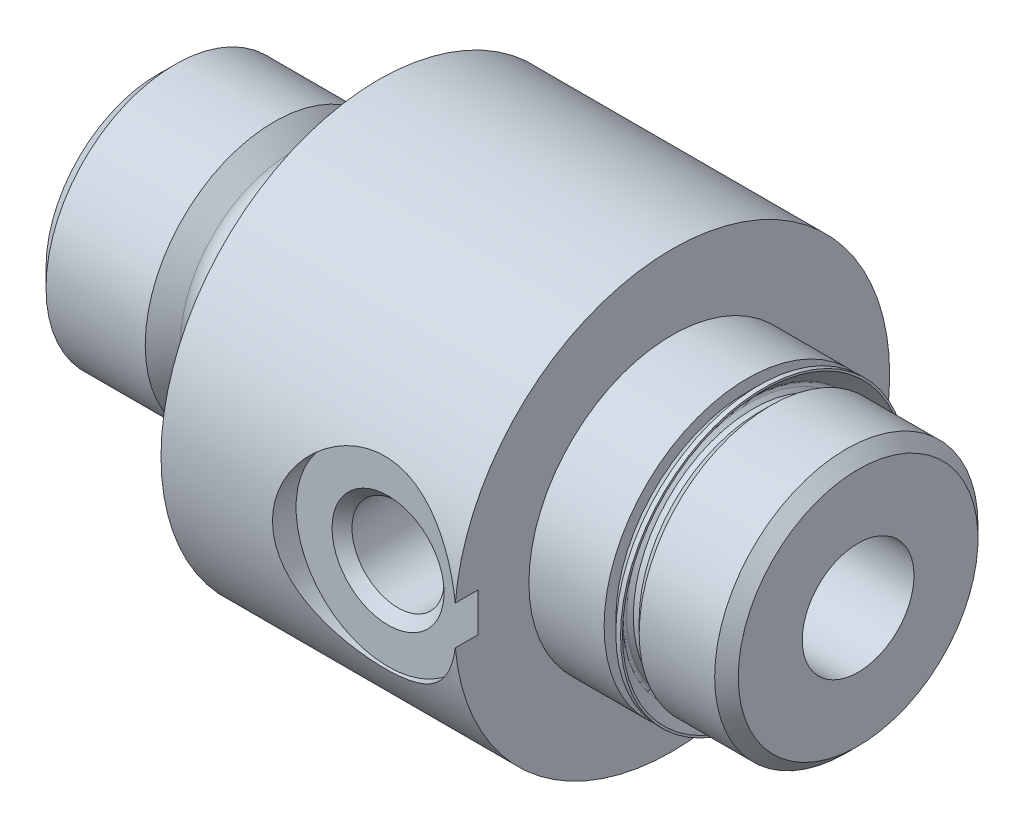
ISO-10303-21;
HEADER;
FILE_DESCRIPTION(('STEP AP214'),'2;1');
FILE_NAME('part.step','',(''),(''),'','','');
FILE_SCHEMA(('AUTOMOTIVE_DESIGN { 1 0 10303 214 1 1 1 1 }'));
ENDSEC;
DATA;
#1=APPLICATION_CONTEXT('core data for automotive mechanical design processes');
#2=APPLICATION_PROTOCOL_DEFINITION('international standard','automotive_design',2000,#1);
#3=PRODUCT_CONTEXT('',#1,'mechanical');
#4=PRODUCT('Part','Part','',(#3));
#5=PRODUCT_RELATED_PRODUCT_CATEGORY('part','',(#4));
#6=PRODUCT_DEFINITION_FORMATION('','',#4);
#7=PRODUCT_DEFINITION_CONTEXT('part definition',#1,'design');
#8=PRODUCT_DEFINITION('design','',#6,#7);
#9=PRODUCT_DEFINITION_SHAPE('','',#8);
#10=(LENGTH_UNIT() NAMED_UNIT(*) SI_UNIT(.MILLI.,.METRE.));
#11=(NAMED_UNIT(*) PLANE_ANGLE_UNIT() SI_UNIT($,.RADIAN.));
#12=(NAMED_UNIT(*) SI_UNIT($,.STERADIAN.) SOLID_ANGLE_UNIT());
#13=UNCERTAINTY_MEASURE_WITH_UNIT(LENGTH_MEASURE(1.E-05),#10,'distance_accuracy_value','');
#14=(GEOMETRIC_REPRESENTATION_CONTEXT(3) GLOBAL_UNCERTAINTY_ASSIGNED_CONTEXT((#13)) GLOBAL_UNIT_ASSIGNED_CONTEXT((#10,
#11,#12)) REPRESENTATION_CONTEXT('',''));
#15=CARTESIAN_POINT('',(0.,0.,0.));
#16=DIRECTION('',(0.,0.,1.));
#17=DIRECTION('',(1.,0.,0.));
#18=AXIS2_PLACEMENT_3D('',#15,#16,#17);
#19=CARTESIAN_POINT('',(30.1752,0.,0.));
#20=DIRECTION('',(-1.,0.,0.));
#21=DIRECTION('',(0.,0.,1.));
#22=AXIS2_PLACEMENT_3D('',#19,#20,#21);
#23=CYLINDRICAL_SURFACE('',#22,5.16255);
#24=CARTESIAN_POINT('',(25.908,0.,0.));
#25=DIRECTION('',(-1.,0.,0.));
#26=DIRECTION('',(0.,0.,1.));
#27=AXIS2_PLACEMENT_3D('',#24,#25,#26);
#28=CIRCLE('',#27,5.16255);
#29=CARTESIAN_POINT('',(25.908,0.,5.16255));
#30=VERTEX_POINT('',#29);
#31=EDGE_CURVE('E103',#30,#30,#28,.T.);
#32=ORIENTED_EDGE('',*,*,#31,.T.);
#33=EDGE_LOOP('',(#32));
#34=FACE_BOUND('',#33,.T.);
#35=CARTESIAN_POINT('',(25.654,0.,0.));
#36=DIRECTION('',(-1.,0.,0.));
#37=DIRECTION('',(0.,0.,1.));
#38=AXIS2_PLACEMENT_3D('',#35,#36,#37);
#39=CIRCLE('',#38,5.16255);
#40=CARTESIAN_POINT('',(25.654,0.,5.16255));
#41=VERTEX_POINT('',#40);
#42=EDGE_CURVE('E43',#41,#41,#39,.T.);
#43=ORIENTED_EDGE('',*,*,#42,.F.);
#44=EDGE_LOOP('',(#43));
#45=FACE_BOUND('',#44,.T.);
#46=ADVANCED_FACE('F35',(#34,#45),#23,.T.);
#47=CARTESIAN_POINT('',(30.1752,0.,0.));
#48=DIRECTION('',(-1.,0.,0.));
#49=DIRECTION('',(0.,0.,1.));
#50=AXIS2_PLACEMENT_3D('',#47,#48,#49);
#51=CYLINDRICAL_SURFACE('',#50,9.3726);
#52=CARTESIAN_POINT('',(9.525,0.,0.));
#53=DIRECTION('',(-1.,0.,0.));
#54=DIRECTION('',(0.,0.,1.));
#55=AXIS2_PLACEMENT_3D('',#52,#53,#54);
#56=CIRCLE('',#55,9.3726);
#57=CARTESIAN_POINT('',(9.525,0.,9.3726));
#58=VERTEX_POINT('',#57);
#59=EDGE_CURVE('E106',#58,#58,#56,.T.);
#60=ORIENTED_EDGE('',*,*,#59,.F.);
#61=EDGE_LOOP('',(#60));
#62=FACE_BOUND('',#61,.T.);
#63=CARTESIAN_POINT('',(22.1615,0.,0.));
#64=DIRECTION('',(1.,0.,0.));
#65=DIRECTION('',(0.,0.,-1.));
#66=AXIS2_PLACEMENT_3D('',#63,#64,#65);
#67=CIRCLE('',#66,9.3726);
#68=CARTESIAN_POINT('',(22.1615,-0.834632559872902,9.33536390560111));
#69=VERTEX_POINT('',#68);
#70=CARTESIAN_POINT('',(22.1615,0.834632559872902,9.33536390560111));
#71=VERTEX_POINT('',#70);
#72=EDGE_CURVE('E72',#69,#71,#67,.T.);
#73=ORIENTED_EDGE('',*,*,#72,.F.);
#74=CARTESIAN_POINT('',(14.3256,0.,9.3726));
#75=CARTESIAN_POINT('',(14.3256007847787,-0.106034358499214,9.37259937566318));
#76=CARTESIAN_POINT('',(14.3298622196159,-0.212102984455135,9.3707955936407));
#77=CARTESIAN_POINT('',(14.3468664680338,-0.423481617946176,9.36362607527876));
#78=CARTESIAN_POINT('',(14.3596145368135,-0.528791114534977,9.35825813190039));
#79=CARTESIAN_POINT('',(14.3934972849969,-0.738045737542348,9.34408523623956));
#80=CARTESIAN_POINT('',(14.4146488451403,-0.841987679988231,9.33527336646095));
#81=CARTESIAN_POINT('',(14.4651133095554,-1.047556732083,9.31444901697212));
#82=CARTESIAN_POINT('',(14.4944295496022,-1.1491828771877,9.30243522916746));
#83=CARTESIAN_POINT('',(14.5939808234609,-1.44876024555991,9.26213021499638));
#84=CARTESIAN_POINT('',(14.6759760866631,-1.64236835016573,9.22950628484626));
#85=CARTESIAN_POINT('',(14.8685029131907,-2.01278792665281,9.15587800701386));
#86=CARTESIAN_POINT('',(14.9790262992579,-2.18960419188745,9.11487606149391));
#87=CARTESIAN_POINT('',(15.2315103799277,-2.53092785028021,9.0262144176742));
#88=CARTESIAN_POINT('',(15.3747035281306,-2.69446744951661,8.97833250538193));
#89=CARTESIAN_POINT('',(15.6858004227496,-2.99602975720291,8.88225999999363));
#90=CARTESIAN_POINT('',(15.8537174498351,-3.1340386611286,8.83406925439525));
#91=CARTESIAN_POINT('',(16.2200529949637,-3.38765546632028,8.74006169142934));
#92=CARTESIAN_POINT('',(16.4195903327512,-3.50176196649314,8.69449128629245));
#93=CARTESIAN_POINT('',(16.7325555755937,-3.64615779691066,8.63445846738749));
#94=CARTESIAN_POINT('',(16.8391976361349,-3.68984076712223,8.61582908095398));
#95=CARTESIAN_POINT('',(17.0563468923013,-3.76788097151651,8.58198791739158));
#96=CARTESIAN_POINT('',(17.1668520476474,-3.80224304694114,8.56677436679898));
#97=CARTESIAN_POINT('',(17.3854286113833,-3.85980930448531,8.54098642274405));
#98=CARTESIAN_POINT('',(17.4933563264975,-3.8834755042994,8.53022213383807));
#99=CARTESIAN_POINT('',(17.7110852655598,-3.92173317835288,8.51270133791138));
#100=CARTESIAN_POINT('',(17.8208855914741,-3.93632888334405,8.50594296248014));
#101=CARTESIAN_POINT('',(18.0414720758414,-3.95627332770152,8.49668487493681));
#102=CARTESIAN_POINT('',(18.1522579532592,-3.96162462325051,8.49418398558494));
#103=CARTESIAN_POINT('',(18.3738964256704,-3.96301861503271,8.49353371249745));
#104=CARTESIAN_POINT('',(18.4847490166587,-3.9590618232777,8.49538408941088));
#105=CARTESIAN_POINT('',(18.6967776343396,-3.94257539486705,8.50304680977758));
#106=CARTESIAN_POINT('',(18.7980210434599,-3.9307537954656,8.50853179372386));
#107=CARTESIAN_POINT('',(18.9990690659652,-3.89940546186073,8.52294286471688));
#108=CARTESIAN_POINT('',(19.0988731989767,-3.87987621414305,8.53187007427391));
#109=CARTESIAN_POINT('',(19.395064425887,-3.8099975930247,8.56342436671249));
#110=CARTESIAN_POINT('',(19.5884041149146,-3.74834347940314,8.59083110661853));
#111=CARTESIAN_POINT('',(19.9659678905179,-3.59548234527021,8.65592932275785));
#112=CARTESIAN_POINT('',(20.1499054263505,-3.50366659560754,8.69382987529455));
#113=CARTESIAN_POINT('',(20.5005201427297,-3.2935027659072,8.77560090245237));
#114=CARTESIAN_POINT('',(20.6671903667937,-3.17514405280551,8.81947376679529));
#115=CARTESIAN_POINT('',(20.9938083360205,-2.90314174689628,8.91290064288197));
#116=CARTESIAN_POINT('',(21.1519008510761,-2.74732059971406,8.96261635498035));
#117=CARTESIAN_POINT('',(21.4403457825917,-2.41089919834485,9.05890665358331));
#118=CARTESIAN_POINT('',(21.5706913156109,-2.2302928136972,9.10548045869415));
#119=CARTESIAN_POINT('',(21.80276908749,-1.84365060297926,9.19166489143267));
#120=CARTESIAN_POINT('',(21.9037256425793,-1.63710186384784,9.23107791130031));
#121=CARTESIAN_POINT('',(22.0688038134091,-1.20785984604516,9.29697422744739));
#122=CARTESIAN_POINT('',(22.1329464027726,-0.985175841556651,9.32346488455126));
#123=CARTESIAN_POINT('',(22.2186447532593,-0.545464501651221,9.35914407576109));
#124=CARTESIAN_POINT('',(22.2426880380652,-0.329003802639673,9.3693414330515));
#125=CARTESIAN_POINT('',(22.2549478079582,0.105082870642386,9.37452109542313));
#126=CARTESIAN_POINT('',(22.2431749678006,0.322708478420071,9.36950793389846));
#127=CARTESIAN_POINT('',(22.1858986104506,0.741157183874648,9.34548143638236));
#128=CARTESIAN_POINT('',(22.1421605486744,0.942268877478597,9.32720120121325));
#129=CARTESIAN_POINT('',(22.0246723649868,1.33406825074195,9.2792711223997));
#130=CARTESIAN_POINT('',(21.9509184796571,1.52475461986018,9.24961985306888));
#131=CARTESIAN_POINT('',(21.7730918070278,1.89700591684724,9.18063010098873));
#132=CARTESIAN_POINT('',(21.6681457193431,2.07810133208087,9.1410185012849));
#133=CARTESIAN_POINT('',(21.4318603483895,2.42076517973475,9.05630886266345));
#134=CARTESIAN_POINT('',(21.300509911422,2.58232531373687,9.01120850837924));
#135=CARTESIAN_POINT('',(21.003904789252,2.89380065179375,8.91627603472376));
#136=CARTESIAN_POINT('',(20.8368681781874,3.04198825237481,8.86633971574651));
#137=CARTESIAN_POINT('',(20.4794060261673,3.30877984848916,8.77027752301089));
#138=CARTESIAN_POINT('',(20.2889745970777,3.42737637352229,8.72415261343456));
#139=CARTESIAN_POINT('',(19.9877123420964,3.58114963365137,8.66164675652079));
#140=CARTESIAN_POINT('',(19.8837424689045,3.62868320436492,8.64178649774071));
#141=CARTESIAN_POINT('',(19.6716285884866,3.71473583311274,8.60514713930563));
#142=CARTESIAN_POINT('',(19.5634864517969,3.7532588773318,8.5883666778831));
#143=CARTESIAN_POINT('',(19.3438523618734,3.82086248256759,8.5585050094943));
#144=CARTESIAN_POINT('',(19.2323620641027,3.84994762873044,8.54542200661824));
#145=CARTESIAN_POINT('',(19.0068747033238,3.89834886124254,8.52345096572075));
#146=CARTESIAN_POINT('',(18.8928778871937,3.91766590523833,8.5145625164788));
#147=CARTESIAN_POINT('',(18.6724421910215,3.94514427064224,8.50186310792561));
#148=CARTESIAN_POINT('',(18.5661174435465,3.95406614678074,8.4977065856986));
#149=CARTESIAN_POINT('',(18.3529758820266,3.96330349290158,8.49340229610692));
#150=CARTESIAN_POINT('',(18.2461589153982,3.96361608542047,8.49325586902833));
#151=CARTESIAN_POINT('',(18.0329711152585,3.95562145805439,8.49698249796804));
#152=CARTESIAN_POINT('',(17.926600073458,3.94731885439652,8.50085340140526));
#153=CARTESIAN_POINT('',(17.7150678249933,3.92220963077061,8.51246621756775));
#154=CARTESIAN_POINT('',(17.6099070895817,3.90539980579485,8.52020958919237));
#155=CARTESIAN_POINT('',(17.3078223601974,3.84454501999024,8.54792993887305));
#156=CARTESIAN_POINT('',(17.1134072337252,3.7896017896873,8.57264650225012));
#157=CARTESIAN_POINT('',(16.7366412962004,3.65161072464814,8.63232020298238));
#158=CARTESIAN_POINT('',(16.5542939130555,3.56855494500744,8.66728023487472));
#159=CARTESIAN_POINT('',(16.1945160861522,3.37084095678001,8.74614398831467));
#160=CARTESIAN_POINT('',(16.0180666548569,3.25456202561235,8.7904636297753));
#161=CARTESIAN_POINT('',(15.686257122934,2.99597602169914,8.88192435734578));
#162=CARTESIAN_POINT('',(15.5309047121298,2.85365950243175,8.92906646326531));
#163=CARTESIAN_POINT('',(15.2334666352567,2.5340734747181,9.02518056300412));
#164=CARTESIAN_POINT('',(15.0932831239778,2.35497080112409,9.0740198320087));
#165=CARTESIAN_POINT('',(14.9070655804226,2.06951033717121,9.14179442064448));
#166=CARTESIAN_POINT('',(14.8489648991632,1.97146837114246,9.16348744685256));
#167=CARTESIAN_POINT('',(14.7412523341999,1.77036195605496,9.20445279877424));
#168=CARTESIAN_POINT('',(14.6916365298898,1.66729985508876,9.22372624140392));
#169=CARTESIAN_POINT('',(14.6020348722108,1.45842374574956,9.25903268180572));
#170=CARTESIAN_POINT('',(14.5619152103807,1.35267458075306,9.27511012065244));
#171=CARTESIAN_POINT('',(14.4907756491452,1.1377620524598,9.3039169912351));
#172=CARTESIAN_POINT('',(14.4597514188693,1.02860034156869,9.31664801609623));
#173=CARTESIAN_POINT('',(14.4071910815189,0.807941947314301,9.33836834936601));
#174=CARTESIAN_POINT('',(14.3856316981371,0.696451706531074,9.34736683393452));
#175=CARTESIAN_POINT('',(14.352157718539,0.471841882197911,9.36139082530379));
#176=CARTESIAN_POINT('',(14.3402361248841,0.358723541560577,9.36641921449781));
#177=CARTESIAN_POINT('',(14.3306672475396,0.204467796659973,9.37045872790099));
#178=CARTESIAN_POINT('',(14.3287675903542,0.163603255935183,9.3712612309043));
#179=CARTESIAN_POINT('',(14.3262338123357,0.0818275111064659,9.37233198860922));
#180=CARTESIAN_POINT('',(14.3255996971713,0.040916306794336,9.37260024091773));
#181=CARTESIAN_POINT('',(14.3256,0.,9.3726));
#182=B_SPLINE_CURVE_WITH_KNOTS('',3,(#74,#75,#76,#77,#78,#79,#80,#81,#82,#83,#84,#85,#86,#87,
#88,#89,#90,#91,#92,#93,#94,#95,#96,#97,#98,#99,#100,#101,#102,#103,#104,#105,#106,#107,#108,
#109,#110,#111,#112,#113,#114,#115,#116,#117,#118,#119,#120,#121,#122,#123,#124,#125,#126,#127,
#128,#129,#130,#131,#132,#133,#134,#135,#136,#137,#138,#139,#140,#141,#142,#143,#144,#145,#146,
#147,#148,#149,#150,#151,#152,#153,#154,#155,#156,#157,#158,#159,#160,#161,#162,#163,#164,#165,
#166,#167,#168,#169,#170,#171,#172,#173,#174,#175,#176,#177,#178,#179,#180,#181),.UNSPECIFIED.,
.T.,.F.,(4,2,2,2,2,2,2,2,2,2,2,2,2,2,2,2,2,2,2,2,2,2,2,2,2,2,2,2,2,2,2,2,2,2,2,2,2,2,2,2,2,2,2,
2,2,2,2,2,2,2,2,2,2,4),(0.,0.31806136029308,0.636319857927257,0.955220924765886,
1.27425247397355,1.90943264637468,2.54443095348157,3.20924541455145,3.87441829880831,
4.5735147959008,4.92333301990615,5.27296920005556,5.60557252582809,5.9380205987319,
6.27037673129927,6.60271458231539,6.90857783121969,7.21454090664446,7.8259501600459,
8.45054656629703,9.07539363314263,9.75475697186341,10.4342886503873,11.1303992868044,
11.8261129409512,12.476800477427,13.1272940998562,13.7443412685281,14.3614658271275,
14.9978241714309,15.6344518925947,16.317852194927,17.0014248528782,17.3491378472873,
17.6966967240738,18.0440864951456,18.3914422021649,18.711364938466,19.0313946005989,
19.351252871729,19.6712317359617,20.2789144211783,20.8867689875549,21.5317600350213,
22.1769855530572,22.8711881202821,23.2188606756693,23.5663721454023,23.9086486211141,
24.2507618531424,24.5920289689756,24.9330480875174,25.055780361164,25.1785131845749),.UNSPECIFIED.);
#183=EDGE_CURVE('E65',#71,#69,#182,.T.);
#184=ORIENTED_EDGE('',*,*,#183,.F.);
#185=EDGE_LOOP('',(#73,#184));
#186=FACE_BOUND('',#185,.T.);
#187=ADVANCED_FACE('F200',(#62,#186),#51,.T.);
#188=CARTESIAN_POINT('',(25.4,9.3726,0.));
#189=DIRECTION('',(-1.,0.,0.));
#190=DIRECTION('',(0.,0.,1.));
#191=AXIS2_PLACEMENT_3D('',#188,#189,#190);
#192=PLANE('',#191);
#193=CARTESIAN_POINT('',(25.4,0.,0.));
#194=DIRECTION('',(-1.,0.,0.));
#195=DIRECTION('',(0.,0.,1.));
#196=AXIS2_PLACEMENT_3D('',#193,#194,#195);
#197=CIRCLE('',#196,5.6603386855597);
#198=CARTESIAN_POINT('',(25.4,0.,5.6603386855597));
#199=VERTEX_POINT('',#198);
#200=EDGE_CURVE('E11',#199,#199,#197,.F.);
#201=ORIENTED_EDGE('',*,*,#200,.F.);
#202=EDGE_LOOP('',(#201));
#203=FACE_BOUND('',#202,.T.);
#204=CARTESIAN_POINT('',(25.4,0.,0.));
#205=DIRECTION('',(-1.,0.,0.));
#206=DIRECTION('',(0.,0.,1.));
#207=AXIS2_PLACEMENT_3D('',#204,#205,#206);
#208=CIRCLE('',#207,6.16585);
#209=CARTESIAN_POINT('',(25.4,0.,6.16585));
#210=VERTEX_POINT('',#209);
#211=EDGE_CURVE('E265',#210,#210,#208,.T.);
#212=ORIENTED_EDGE('',*,*,#211,.F.);
#213=EDGE_LOOP('',(#212));
#214=FACE_BOUND('',#213,.T.);
#215=ADVANCED_FACE('F164',(#203,#214),#192,.F.);
#216=CARTESIAN_POINT('',(18.288,0.,9.3726));
#217=DIRECTION('',(0.,0.,-1.));
#218=DIRECTION('',(-1.,0.,0.));
#219=AXIS2_PLACEMENT_3D('',#216,#217,#218);
#220=CYLINDRICAL_SURFACE('',#219,3.9624);
#221=ORIENTED_EDGE('',*,*,#183,.T.);
#222=DIRECTION('',(0.,0.,-1.));
#223=VECTOR('',#222,1.);
#224=CARTESIAN_POINT('',(22.1615,-0.834632559872902,9.3726));
#225=LINE('',#224,#223);
#226=CARTESIAN_POINT('',(22.1615,-0.834632559872902,8.3566));
#227=VERTEX_POINT('',#226);
#228=EDGE_CURVE('E55',#69,#227,#225,.T.);
#229=ORIENTED_EDGE('',*,*,#228,.T.);
#230=CARTESIAN_POINT('',(18.288,0.,8.3566));
#231=DIRECTION('',(0.,0.,-1.));
#232=DIRECTION('',(-1.,0.,0.));
#233=AXIS2_PLACEMENT_3D('',#230,#231,#232);
#234=CIRCLE('',#233,3.9624);
#235=CARTESIAN_POINT('',(22.1615,0.834632559872902,8.3566));
#236=VERTEX_POINT('',#235);
#237=EDGE_CURVE('E70',#227,#236,#234,.T.);
#238=ORIENTED_EDGE('',*,*,#237,.T.);
#239=DIRECTION('',(0.,0.,-1.));
#240=VECTOR('',#239,1.);
#241=CARTESIAN_POINT('',(22.1615,0.834632559872902,9.3726));
#242=LINE('',#241,#240);
#243=EDGE_CURVE('E50',#236,#71,#242,.F.);
#244=ORIENTED_EDGE('',*,*,#243,.T.);
#245=EDGE_LOOP('',(#221,#229,#238,#244));
#246=FACE_BOUND('',#245,.T.);
#247=ADVANCED_FACE('F69',(#246),#220,.F.);
#248=CARTESIAN_POINT('',(20.701,0.,8.3566));
#249=DIRECTION('',(0.,0.,1.));
#250=DIRECTION('',(1.,0.,0.));
#251=AXIS2_PLACEMENT_3D('',#248,#249,#250);
#252=PLANE('',#251);
#253=CARTESIAN_POINT('',(18.288,0.,8.3566));
#254=DIRECTION('',(0.,0.,-1.));
#255=DIRECTION('',(-1.,0.,0.));
#256=AXIS2_PLACEMENT_3D('',#253,#254,#255);
#257=CIRCLE('',#256,2.413);
#258=CARTESIAN_POINT('',(15.875,0.,8.3566));
#259=VERTEX_POINT('',#258);
#260=EDGE_CURVE('E75',#259,#259,#257,.T.);
#261=ORIENTED_EDGE('',*,*,#260,.T.);
#262=EDGE_LOOP('',(#261));
#263=FACE_BOUND('',#262,.T.);
#264=ORIENTED_EDGE('',*,*,#237,.F.);
#265=DIRECTION('',(0.,1.,0.));
#266=VECTOR('',#265,1.);
#267=CARTESIAN_POINT('',(22.1615,0.,8.3566));
#268=LINE('',#267,#266);
#269=EDGE_CURVE('E60',#227,#236,#268,.T.);
#270=ORIENTED_EDGE('',*,*,#269,.T.);
#271=EDGE_LOOP('',(#264,#270));
#272=FACE_BOUND('',#271,.T.);
#273=ADVANCED_FACE('F74',(#263,#272),#252,.T.);
#274=CARTESIAN_POINT('',(30.1752,0.,0.));
#275=DIRECTION('',(-1.,0.,0.));
#276=DIRECTION('',(0.,0.,1.));
#277=AXIS2_PLACEMENT_3D('',#274,#275,#276);
#278=CYLINDRICAL_SURFACE('',#277,2.40665);
#279=CARTESIAN_POINT('',(30.1752,0.,0.));
#280=DIRECTION('',(-1.,0.,0.));
#281=DIRECTION('',(0.,0.,1.));
#282=AXIS2_PLACEMENT_3D('',#279,#280,#281);
#283=CIRCLE('',#282,2.40665);
#284=CARTESIAN_POINT('',(30.1752,0.,2.40665));
#285=VERTEX_POINT('',#284);
#286=EDGE_CURVE('E85',#285,#285,#283,.T.);
#287=ORIENTED_EDGE('',*,*,#286,.F.);
#288=EDGE_LOOP('',(#287));
#289=FACE_BOUND('',#288,.T.);
#290=CARTESIAN_POINT('',(0.508000000000002,0.,0.));
#291=DIRECTION('',(-1.,0.,0.));
#292=DIRECTION('',(0.,0.,1.));
#293=AXIS2_PLACEMENT_3D('',#290,#291,#292);
#294=CIRCLE('',#293,2.40665);
#295=CARTESIAN_POINT('',(0.508000000000002,0.,2.40665));
#296=VERTEX_POINT('',#295);
#297=EDGE_CURVE('E88',#296,#296,#294,.T.);
#298=ORIENTED_EDGE('',*,*,#297,.T.);
#299=EDGE_LOOP('',(#298));
#300=FACE_BOUND('',#299,.T.);
#301=CARTESIAN_POINT('',(20.27174,0.,2.40665));
#302=CARTESIAN_POINT('',(20.271732083611,0.0944665266148717,2.40664227817569));
#303=CARTESIAN_POINT('',(20.264938281244,0.189022688118429,2.40103400474686));
#304=CARTESIAN_POINT('',(20.2382407274094,0.375036425841802,2.37910138201514));
#305=CARTESIAN_POINT('',(20.2183171046315,0.466489084126017,2.36276079002454));
#306=CARTESIAN_POINT('',(20.1668351040403,0.643131246397745,2.32089161849654));
#307=CARTESIAN_POINT('',(20.1353493880645,0.728355963070288,2.2954204433231));
#308=CARTESIAN_POINT('',(20.0623471352527,0.891585964550189,2.2370893523968));
#309=CARTESIAN_POINT('',(20.0208287598189,0.969589922444068,2.20422808240251));
#310=CARTESIAN_POINT('',(19.9126422340187,1.14447786819001,2.12005822248041));
#311=CARTESIAN_POINT('',(19.84231266377,1.23795870823166,2.06638022030208));
#312=CARTESIAN_POINT('',(19.6885321536435,1.40964208958544,1.95332961471516));
#313=CARTESIAN_POINT('',(19.605044209136,1.48780010470503,1.89394114145528));
#314=CARTESIAN_POINT('',(19.4247395722244,1.62986684612,1.7732117342424));
#315=CARTESIAN_POINT('',(19.3277125761668,1.69349798625319,1.71185485552847));
#316=CARTESIAN_POINT('',(19.1731185392029,1.77628372716905,1.62431828701694));
#317=CARTESIAN_POINT('',(19.1201234563902,1.80175375812465,1.59590978250623));
#318=CARTESIAN_POINT('',(19.0109356834055,1.84827208038185,1.54179133245285));
#319=CARTESIAN_POINT('',(18.9547457937074,1.86932417063162,1.51607907802767));
#320=CARTESIAN_POINT('',(18.8327470222155,1.90866811307985,1.46630957139254));
#321=CARTESIAN_POINT('',(18.7665560734158,1.9264123297991,1.44273489310752));
#322=CARTESIAN_POINT('',(18.6305316382862,1.9551740221339,1.40351601713772));
#323=CARTESIAN_POINT('',(18.5607076586563,1.96620818141848,1.38785216681841));
#324=CARTESIAN_POINT('',(18.4178340368811,1.98079801512445,1.36696168575298));
#325=CARTESIAN_POINT('',(18.3447571077889,1.98426892569324,1.36185338708201));
#326=CARTESIAN_POINT('',(18.1988046589964,1.98307846450031,1.36358448122013));
#327=CARTESIAN_POINT('',(18.1259292089748,1.97841456417784,1.37042758891142));
#328=CARTESIAN_POINT('',(17.975358232337,1.96057100804832,1.39584227330881));
#329=CARTESIAN_POINT('',(17.8979733448864,1.94653915010946,1.41558282154708));
#330=CARTESIAN_POINT('',(17.7479520114763,1.91038435433696,1.46400011383434));
#331=CARTESIAN_POINT('',(17.6753317190683,1.88823541539069,1.49270553050758));
#332=CARTESIAN_POINT('',(17.5504563216836,1.84246025373771,1.54864974648623));
#333=CARTESIAN_POINT('',(17.4972078363799,1.82020377099369,1.57484894727813));
#334=CARTESIAN_POINT('',(17.3936774155696,1.77163222700847,1.62930009150414));
#335=CARTESIAN_POINT('',(17.3433971377681,1.74531492695382,1.65755316270792));
#336=CARTESIAN_POINT('',(17.1967539967516,1.66047944683466,1.74392035275728));
#337=CARTESIAN_POINT('',(17.1046436972852,1.59609827564095,1.80361560683221));
#338=CARTESIAN_POINT('',(16.9281467643951,1.44906291232317,1.92396686313826));
#339=CARTESIAN_POINT('',(16.8442769958811,1.36573038709953,1.9845499210859));
#340=CARTESIAN_POINT('',(16.6909520146864,1.18272201505033,2.09873888418448));
#341=CARTESIAN_POINT('',(16.6214630753337,1.08308541207722,2.15236100172847));
#342=CARTESIAN_POINT('',(16.5160741514393,0.896539089550019,2.23510750096793));
#343=CARTESIAN_POINT('',(16.4761431391089,0.813124249591012,2.26697037376801));
#344=CARTESIAN_POINT('',(16.4076816971062,0.63902592769032,2.32205095802316));
#345=CARTESIAN_POINT('',(16.3791434707341,0.548347467837322,2.34527458103991));
#346=CARTESIAN_POINT('',(16.3350298297872,0.361153707750091,2.38131666245983));
#347=CARTESIAN_POINT('',(16.3195444689695,0.264602707750548,2.39406282048912));
#348=CARTESIAN_POINT('',(16.3030634922475,0.0694466223280691,2.40763145906262));
#349=CARTESIAN_POINT('',(16.3020606714072,-0.0291574172724766,2.40845986858087));
#350=CARTESIAN_POINT('',(16.3139132332595,-0.214150611939814,2.39869783182771));
#351=CARTESIAN_POINT('',(16.3252819807325,-0.300707759450095,2.38933231574157));
#352=CARTESIAN_POINT('',(16.3588599806674,-0.470225803750744,2.36182736715262));
#353=CARTESIAN_POINT('',(16.3810709939627,-0.553186114014712,2.34368650949867));
#354=CARTESIAN_POINT('',(16.4359440489433,-0.716040404246647,2.29925727846078));
#355=CARTESIAN_POINT('',(16.4688874866116,-0.795778263179251,2.27275021016908));
#356=CARTESIAN_POINT('',(16.5435922139961,-0.948418008217704,2.21341031580642));
#357=CARTESIAN_POINT('',(16.5853563085294,-1.02131770923345,2.18057547790508));
#358=CARTESIAN_POINT('',(16.6970558079369,-1.19105315632743,2.09429288698658));
#359=CARTESIAN_POINT('',(16.7711901083829,-1.28380569367109,2.0382382445847));
#360=CARTESIAN_POINT('',(16.9328595831294,-1.45349214275559,1.92093559938729));
#361=CARTESIAN_POINT('',(17.0204427413482,-1.53036700592303,1.85966936589484));
#362=CARTESIAN_POINT('',(17.1616439843106,-1.63402087437716,1.76752305857778));
#363=CARTESIAN_POINT('',(17.2108246226197,-1.66686404186151,1.73649331187815));
#364=CARTESIAN_POINT('',(17.3124015352713,-1.72828206801288,1.67537418004322));
#365=CARTESIAN_POINT('',(17.3647992056835,-1.75685505484699,1.64528521184141));
#366=CARTESIAN_POINT('',(17.4726836163731,-1.80943932818475,1.58726815784957));
#367=CARTESIAN_POINT('',(17.528157725088,-1.83346770643541,1.55933221966486));
#368=CARTESIAN_POINT('',(17.6424600335992,-1.87676116983256,1.50694542358346));
#369=CARTESIAN_POINT('',(17.7012842166922,-1.8960318174011,1.48249051021143));
#370=CARTESIAN_POINT('',(17.825373240103,-1.93016564151887,1.43779577359626));
#371=CARTESIAN_POINT('',(17.8908128397301,-1.94476259320278,1.41782539771858));
#372=CARTESIAN_POINT('',(18.024711682745,-1.96735573238082,1.38631208874035));
#373=CARTESIAN_POINT('',(18.0931625289768,-1.97536918445334,1.37474712253859));
#374=CARTESIAN_POINT('',(18.2321033893806,-1.98418004009117,1.36200770781593));
#375=CARTESIAN_POINT('',(18.3026052773875,-1.98491965668776,1.36091646944211));
#376=CARTESIAN_POINT('',(18.4426514778705,-1.97894837040621,1.36957929771529));
#377=CARTESIAN_POINT('',(18.5121944964069,-1.97222823997276,1.37934679642152));
#378=CARTESIAN_POINT('',(18.6630348304667,-1.94976722089615,1.41096104936783));
#379=CARTESIAN_POINT('',(18.7436138232841,-1.9323871649794,1.43496662881896));
#380=CARTESIAN_POINT('',(18.8992569531789,-1.88895874150639,1.49166492915251));
#381=CARTESIAN_POINT('',(18.9743026224265,-1.86288282018878,1.52438519622515));
#382=CARTESIAN_POINT('',(19.1025994005462,-1.80978657569382,1.5867976291518));
#383=CARTESIAN_POINT('',(19.1569701594641,-1.78428280615956,1.61552942833152));
#384=CARTESIAN_POINT('',(19.2625017162326,-1.72890790823879,1.67466021726515));
#385=CARTESIAN_POINT('',(19.3136608537092,-1.69903454696596,1.7050600544032));
#386=CARTESIAN_POINT('',(19.4625462907842,-1.60301030669421,1.79726722085469));
#387=CARTESIAN_POINT('',(19.5556438657573,-1.53047074497562,1.86006282937337));
#388=CARTESIAN_POINT('',(19.7312375957919,-1.3664293914361,1.98387238608033));
#389=CARTESIAN_POINT('',(19.8133570710222,-1.27444710289375,2.04478491474354));
#390=CARTESIAN_POINT('',(19.9610444876563,-1.07313156133467,2.15720649367432));
#391=CARTESIAN_POINT('',(20.0266590916067,-0.963848680969058,2.20874193788445));
#392=CARTESIAN_POINT('',(20.1198306276474,-0.766506294151003,2.28294317814052));
#393=CARTESIAN_POINT('',(20.1528709505076,-0.682517432180892,2.30959577774667));
#394=CARTESIAN_POINT('',(20.2075478948831,-0.508730545312804,2.35396352401005));
#395=CARTESIAN_POINT('',(20.2292089739206,-0.418945448928548,2.37169783529598));
#396=CARTESIAN_POINT('',(20.2535274333724,-0.27369712694528,2.39165514743912));
#397=CARTESIAN_POINT('',(20.2603379912707,-0.219350815547072,2.39725889761492));
#398=CARTESIAN_POINT('',(20.2694471404593,-0.11001324338182,2.40475903316864));
#399=CARTESIAN_POINT('',(20.2717446108838,-0.0550218258074009,2.40665449756001));
#400=CARTESIAN_POINT('',(20.27174,0.,2.40665));
#401=B_SPLINE_CURVE_WITH_KNOTS('',3,(#301,#302,#303,#304,#305,#306,#307,#308,#309,#310,#311,
#312,#313,#314,#315,#316,#317,#318,#319,#320,#321,#322,#323,#324,#325,#326,#327,#328,#329,#330,
#331,#332,#333,#334,#335,#336,#337,#338,#339,#340,#341,#342,#343,#344,#345,#346,#347,#348,#349,
#350,#351,#352,#353,#354,#355,#356,#357,#358,#359,#360,#361,#362,#363,#364,#365,#366,#367,#368,
#369,#370,#371,#372,#373,#374,#375,#376,#377,#378,#379,#380,#381,#382,#383,#384,#385,#386,#387,
#388,#389,#390,#391,#392,#393,#394,#395,#396,#397,#398,#399,#400),.UNSPECIFIED.,.T.,.F.,(4,2,2,
2,2,2,2,2,2,2,2,2,2,2,2,2,2,2,2,2,2,2,2,2,2,2,2,2,2,2,2,2,2,2,2,2,2,2,2,2,2,2,2,2,2,2,2,2,2,4),
(0.,0.283162935535792,0.566755410899833,0.848595329630822,1.13048693792319,1.51454143646913,
1.89969592462705,2.29168773357922,2.48737635412506,2.68289600795078,2.89963805865166,
3.11583898177491,3.33445073977214,3.55313046144226,3.79504647792914,4.03774428584482,
4.22764118015091,4.41764314514186,4.79783827153698,5.19473069818221,5.59068149129778,
5.8829948501314,6.17510781876932,6.46921999834796,6.76318585466661,7.02536792513004,
7.28759258932972,7.55733585643209,7.82716502673671,8.21901226255658,8.61229151981617,
8.81247321497212,9.01274240396693,9.21224273713694,9.41150871137879,9.62066475518132,
9.82927054116325,10.039532269227,10.2500543768851,10.5061945172443,10.7631541005878,
10.962623516766,11.1621952213783,11.5614701021252,11.9720972208077,12.3815500259933,
12.6627814245088,12.9434058706648,13.1082925691996,13.2732202136517),.UNSPECIFIED.);
#402=CARTESIAN_POINT('',(20.27174,0.,2.40665));
#403=VERTEX_POINT('',#402);
#404=EDGE_CURVE('E84',#403,#403,#401,.T.);
#405=ORIENTED_EDGE('',*,*,#404,.T.);
#406=EDGE_LOOP('',(#405));
#407=FACE_BOUND('',#406,.T.);
#408=ADVANCED_FACE('F146',(#289,#300,#407),#278,.F.);
#409=CARTESIAN_POINT('',(9.525,0.,0.));
#410=DIRECTION('',(-1.,0.,0.));
#411=DIRECTION('',(0.,0.,1.));
#412=AXIS2_PLACEMENT_3D('',#409,#410,#411);
#413=CYLINDRICAL_SURFACE('',#412,5.5245);
#414=CARTESIAN_POINT('',(8.3185,0.,0.));
#415=DIRECTION('',(-1.,0.,0.));
#416=DIRECTION('',(0.,0.,1.));
#417=AXIS2_PLACEMENT_3D('',#414,#415,#416);
#418=CIRCLE('',#417,5.5245);
#419=CARTESIAN_POINT('',(8.3185,0.,5.5245));
#420=VERTEX_POINT('',#419);
#421=EDGE_CURVE('E133',#420,#420,#418,.T.);
#422=ORIENTED_EDGE('',*,*,#421,.F.);
#423=EDGE_LOOP('',(#422));
#424=FACE_BOUND('',#423,.T.);
#425=CARTESIAN_POINT('',(9.525,0.,0.));
#426=DIRECTION('',(1.,0.,0.));
#427=DIRECTION('',(0.,0.,-1.));
#428=AXIS2_PLACEMENT_3D('',#425,#426,#427);
#429=CIRCLE('',#428,5.5245);
#430=CARTESIAN_POINT('',(9.525,0.,-5.5245));
#431=VERTEX_POINT('',#430);
#432=EDGE_CURVE('E109',#431,#431,#429,.T.);
#433=ORIENTED_EDGE('',*,*,#432,.F.);
#434=EDGE_LOOP('',(#433));
#435=FACE_BOUND('',#434,.T.);
#436=ADVANCED_FACE('F37',(#424,#435),#413,.T.);
#437=CARTESIAN_POINT('',(8.3185,5.3721,0.));
#438=DIRECTION('',(1.,0.,0.));
#439=DIRECTION('',(0.,0.,-1.));
#440=AXIS2_PLACEMENT_3D('',#437,#438,#439);
#441=PLANE('',#440);
#442=CARTESIAN_POINT('',(8.3185,0.,0.));
#443=DIRECTION('',(-1.,0.,0.));
#444=DIRECTION('',(0.,0.,1.));
#445=AXIS2_PLACEMENT_3D('',#442,#443,#444);
#446=CIRCLE('',#445,5.3721);
#447=CARTESIAN_POINT('',(8.3185,0.,5.3721));
#448=VERTEX_POINT('',#447);
#449=EDGE_CURVE('E130',#448,#448,#446,.T.);
#450=ORIENTED_EDGE('',*,*,#449,.F.);
#451=EDGE_LOOP('',(#450));
#452=FACE_BOUND('',#451,.T.);
#453=ORIENTED_EDGE('',*,*,#421,.T.);
#454=EDGE_LOOP('',(#453));
#455=FACE_BOUND('',#454,.T.);
#456=ADVANCED_FACE('F246',(#452,#455),#441,.F.);
#457=CARTESIAN_POINT('',(7.51840000000015,0.,0.));
#458=DIRECTION('',(-1.,0.,0.));
#459=DIRECTION('',(0.,0.,1.));
#460=AXIS2_PLACEMENT_3D('',#457,#458,#459);
#461=TOROIDAL_SURFACE('',#460,5.37209999999985,0.800099999999851);
#462=CARTESIAN_POINT('',(7.5184,0.,0.));
#463=DIRECTION('',(-1.,0.,0.));
#464=DIRECTION('',(0.,0.,1.));
#465=AXIS2_PLACEMENT_3D('',#462,#463,#464);
#466=CIRCLE('',#465,4.572);
#467=CARTESIAN_POINT('',(7.5184,0.,4.572));
#468=VERTEX_POINT('',#467);
#469=EDGE_CURVE('E127',#468,#468,#466,.T.);
#470=ORIENTED_EDGE('',*,*,#469,.F.);
#471=EDGE_LOOP('',(#470));
#472=FACE_BOUND('',#471,.T.);
#473=ORIENTED_EDGE('',*,*,#449,.T.);
#474=EDGE_LOOP('',(#473));
#475=FACE_BOUND('',#474,.T.);
#476=ADVANCED_FACE('F243',(#472,#475),#461,.F.);
#477=CARTESIAN_POINT('',(9.525,0.,0.));
#478=DIRECTION('',(-1.,0.,0.));
#479=DIRECTION('',(0.,0.,1.));
#480=AXIS2_PLACEMENT_3D('',#477,#478,#479);
#481=CYLINDRICAL_SURFACE('',#480,4.572);
#482=CARTESIAN_POINT('',(6.35,0.,0.));
#483=DIRECTION('',(-1.,0.,0.));
#484=DIRECTION('',(0.,0.,1.));
#485=AXIS2_PLACEMENT_3D('',#482,#483,#484);
#486=CIRCLE('',#485,4.572);
#487=CARTESIAN_POINT('',(6.35,0.,4.572));
#488=VERTEX_POINT('',#487);
#489=EDGE_CURVE('E124',#488,#488,#486,.T.);
#490=ORIENTED_EDGE('',*,*,#489,.F.);
#491=EDGE_LOOP('',(#490));
#492=FACE_BOUND('',#491,.T.);
#493=ORIENTED_EDGE('',*,*,#469,.T.);
#494=EDGE_LOOP('',(#493));
#495=FACE_BOUND('',#494,.T.);
#496=ADVANCED_FACE('F239',(#492,#495),#481,.T.);
#497=CARTESIAN_POINT('',(6.35000000000007,0.,0.));
#498=DIRECTION('',(-1.,0.,0.));
#499=DIRECTION('',(0.,0.,1.));
#500=AXIS2_PLACEMENT_3D('',#497,#498,#499);
#501=TOROIDAL_SURFACE('',#500,5.37210000000021,0.800100000000211);
#502=CARTESIAN_POINT('',(5.7864032913718,0.,0.));
#503=DIRECTION('',(-1.,0.,0.));
#504=DIRECTION('',(0.,0.,1.));
#505=AXIS2_PLACEMENT_3D('',#502,#503,#504);
#506=CIRCLE('',#505,4.8041926483805);
#507=CARTESIAN_POINT('',(5.7864032913718,0.,4.8041926483805));
#508=VERTEX_POINT('',#507);
#509=EDGE_CURVE('E121',#508,#508,#506,.T.);
#510=ORIENTED_EDGE('',*,*,#509,.F.);
#511=EDGE_LOOP('',(#510));
#512=FACE_BOUND('',#511,.T.);
#513=ORIENTED_EDGE('',*,*,#489,.T.);
#514=EDGE_LOOP('',(#513));
#515=FACE_BOUND('',#514,.T.);
#516=ADVANCED_FACE('F235',(#512,#515),#501,.F.);
#517=CARTESIAN_POINT('',(5.7864032913718,0.,0.));
#518=DIRECTION('',(-1.,0.,0.));
#519=DIRECTION('',(0.,0.,1.));
#520=AXIS2_PLACEMENT_3D('',#517,#518,#519);
#521=CONICAL_SURFACE('',#520,4.8041926483805,0.781588524273101);
#522=CARTESIAN_POINT('',(5.0285938643726,0.,0.));
#523=DIRECTION('',(-1.,0.,0.));
#524=DIRECTION('',(0.,0.,1.));
#525=AXIS2_PLACEMENT_3D('',#522,#523,#524);
#526=CIRCLE('',#525,5.55625);
#527=CARTESIAN_POINT('',(5.0285938643726,0.,5.55625));
#528=VERTEX_POINT('',#527);
#529=EDGE_CURVE('E118',#528,#528,#526,.T.);
#530=ORIENTED_EDGE('',*,*,#529,.F.);
#531=EDGE_LOOP('',(#530));
#532=FACE_BOUND('',#531,.T.);
#533=ORIENTED_EDGE('',*,*,#509,.T.);
#534=EDGE_LOOP('',(#533));
#535=FACE_BOUND('',#534,.T.);
#536=ADVANCED_FACE('F231',(#532,#535),#521,.T.);
#537=CARTESIAN_POINT('',(9.525,0.,0.));
#538=DIRECTION('',(-1.,0.,0.));
#539=DIRECTION('',(0.,0.,1.));
#540=AXIS2_PLACEMENT_3D('',#537,#538,#539);
#541=CYLINDRICAL_SURFACE('',#540,5.55625);
#542=CARTESIAN_POINT('',(0.75565,0.,0.));
#543=DIRECTION('',(-1.,0.,0.));
#544=DIRECTION('',(0.,0.,1.));
#545=AXIS2_PLACEMENT_3D('',#542,#543,#544);
#546=CIRCLE('',#545,5.55625);
#547=CARTESIAN_POINT('',(0.75565,0.,5.55625));
#548=VERTEX_POINT('',#547);
#549=EDGE_CURVE('E115',#548,#548,#546,.T.);
#550=ORIENTED_EDGE('',*,*,#549,.F.);
#551=EDGE_LOOP('',(#550));
#552=FACE_BOUND('',#551,.T.);
#553=ORIENTED_EDGE('',*,*,#529,.T.);
#554=EDGE_LOOP('',(#553));
#555=FACE_BOUND('',#554,.T.);
#556=ADVANCED_FACE('F227',(#552,#555),#541,.T.);
#557=CARTESIAN_POINT('',(0.75565,0.,0.));
#558=DIRECTION('',(1.,0.,0.));
#559=DIRECTION('',(0.,0.,-1.));
#560=AXIS2_PLACEMENT_3D('',#557,#558,#559);
#561=CONICAL_SURFACE('',#560,5.55625,0.785398163397448);
#562=CARTESIAN_POINT('',(0.,0.,0.));
#563=DIRECTION('',(-1.,0.,0.));
#564=DIRECTION('',(0.,0.,1.));
#565=AXIS2_PLACEMENT_3D('',#562,#563,#564);
#566=CIRCLE('',#565,4.8006);
#567=CARTESIAN_POINT('',(0.,0.,4.8006));
#568=VERTEX_POINT('',#567);
#569=EDGE_CURVE('E112',#568,#568,#566,.T.);
#570=ORIENTED_EDGE('',*,*,#569,.F.);
#571=EDGE_LOOP('',(#570));
#572=FACE_BOUND('',#571,.T.);
#573=ORIENTED_EDGE('',*,*,#549,.T.);
#574=EDGE_LOOP('',(#573));
#575=FACE_BOUND('',#574,.T.);
#576=ADVANCED_FACE('F223',(#572,#575),#561,.T.);
#577=CARTESIAN_POINT('',(0.,0.,0.));
#578=DIRECTION('',(1.,0.,0.));
#579=DIRECTION('',(0.,0.,-1.));
#580=AXIS2_PLACEMENT_3D('',#577,#578,#579);
#581=PLANE('',#580);
#582=CARTESIAN_POINT('',(0.,0.,0.));
#583=DIRECTION('',(-1.,0.,0.));
#584=DIRECTION('',(0.,0.,1.));
#585=AXIS2_PLACEMENT_3D('',#582,#583,#584);
#586=CIRCLE('',#585,2.91465);
#587=CARTESIAN_POINT('',(0.,0.,2.91465));
#588=VERTEX_POINT('',#587);
#589=EDGE_CURVE('E91',#588,#588,#586,.T.);
#590=ORIENTED_EDGE('',*,*,#589,.F.);
#591=EDGE_LOOP('',(#590));
#592=FACE_BOUND('',#591,.T.);
#593=ORIENTED_EDGE('',*,*,#569,.T.);
#594=EDGE_LOOP('',(#593));
#595=FACE_BOUND('',#594,.T.);
#596=ADVANCED_FACE('F219',(#592,#595),#581,.F.);
#597=CARTESIAN_POINT('',(9.525,0.,0.));
#598=DIRECTION('',(1.,0.,0.));
#599=DIRECTION('',(0.,0.,-1.));
#600=AXIS2_PLACEMENT_3D('',#597,#598,#599);
#601=PLANE('',#600);
#602=ORIENTED_EDGE('',*,*,#432,.T.);
#603=EDGE_LOOP('',(#602));
#604=FACE_BOUND('',#603,.T.);
#605=ORIENTED_EDGE('',*,*,#59,.T.);
#606=EDGE_LOOP('',(#605));
#607=FACE_BOUND('',#606,.T.);
#608=ADVANCED_FACE('F216',(#604,#607),#601,.F.);
#609=CARTESIAN_POINT('',(26.416,0.,0.));
#610=DIRECTION('',(1.,0.,0.));
#611=DIRECTION('',(0.,0.,-1.));
#612=AXIS2_PLACEMENT_3D('',#609,#610,#611);
#613=CONICAL_SURFACE('',#612,5.67055,0.78539816339745);
#614=ORIENTED_EDGE('',*,*,#31,.F.);
#615=EDGE_LOOP('',(#614));
#616=FACE_BOUND('',#615,.T.);
#617=CARTESIAN_POINT('',(26.416,0.,0.));
#618=DIRECTION('',(-1.,0.,0.));
#619=DIRECTION('',(0.,0.,1.));
#620=AXIS2_PLACEMENT_3D('',#617,#618,#619);
#621=CIRCLE('',#620,5.67055);
#622=CARTESIAN_POINT('',(26.416,0.,5.67055));
#623=VERTEX_POINT('',#622);
#624=EDGE_CURVE('E100',#623,#623,#621,.T.);
#625=ORIENTED_EDGE('',*,*,#624,.T.);
#626=EDGE_LOOP('',(#625));
#627=FACE_BOUND('',#626,.T.);
#628=ADVANCED_FACE('F210',(#616,#627),#613,.T.);
#629=CARTESIAN_POINT('',(30.1752,0.,0.));
#630=DIRECTION('',(-1.,0.,0.));
#631=DIRECTION('',(0.,0.,1.));
#632=AXIS2_PLACEMENT_3D('',#629,#630,#631);
#633=CYLINDRICAL_SURFACE('',#632,5.67055);
#634=ORIENTED_EDGE('',*,*,#624,.F.);
#635=EDGE_LOOP('',(#634));
#636=FACE_BOUND('',#635,.T.);
#637=CARTESIAN_POINT('',(29.6672,0.,0.));
#638=DIRECTION('',(-1.,0.,0.));
#639=DIRECTION('',(0.,0.,1.));
#640=AXIS2_PLACEMENT_3D('',#637,#638,#639);
#641=CIRCLE('',#640,5.67055);
#642=CARTESIAN_POINT('',(29.6672,0.,5.67055));
#643=VERTEX_POINT('',#642);
#644=EDGE_CURVE('E97',#643,#643,#641,.T.);
#645=ORIENTED_EDGE('',*,*,#644,.T.);
#646=EDGE_LOOP('',(#645));
#647=FACE_BOUND('',#646,.T.);
#648=ADVANCED_FACE('F325',(#636,#647),#633,.T.);
#649=CARTESIAN_POINT('',(30.1752,0.,0.));
#650=DIRECTION('',(-1.,0.,0.));
#651=DIRECTION('',(0.,0.,1.));
#652=AXIS2_PLACEMENT_3D('',#649,#650,#651);
#653=CONICAL_SURFACE('',#652,5.16255,0.78539816339745);
#654=ORIENTED_EDGE('',*,*,#644,.F.);
#655=EDGE_LOOP('',(#654));
#656=FACE_BOUND('',#655,.T.);
#657=CARTESIAN_POINT('',(30.1752,0.,0.));
#658=DIRECTION('',(-1.,0.,0.));
#659=DIRECTION('',(0.,0.,1.));
#660=AXIS2_PLACEMENT_3D('',#657,#658,#659);
#661=CIRCLE('',#660,5.16255);
#662=CARTESIAN_POINT('',(30.1752,0.,5.16255));
#663=VERTEX_POINT('',#662);
#664=EDGE_CURVE('E94',#663,#663,#661,.T.);
#665=ORIENTED_EDGE('',*,*,#664,.T.);
#666=EDGE_LOOP('',(#665));
#667=FACE_BOUND('',#666,.T.);
#668=ADVANCED_FACE('F320',(#656,#667),#653,.T.);
#669=CARTESIAN_POINT('',(30.1752,5.16255,0.));
#670=DIRECTION('',(-1.,0.,0.));
#671=DIRECTION('',(0.,0.,1.));
#672=AXIS2_PLACEMENT_3D('',#669,#670,#671);
#673=PLANE('',#672);
#674=ORIENTED_EDGE('',*,*,#286,.T.);
#675=EDGE_LOOP('',(#674));
#676=FACE_BOUND('',#675,.T.);
#677=ORIENTED_EDGE('',*,*,#664,.F.);
#678=EDGE_LOOP('',(#677));
#679=FACE_BOUND('',#678,.T.);
#680=ADVANCED_FACE('F315',(#676,#679),#673,.F.);
#681=CARTESIAN_POINT('',(0.508000000000002,0.,0.));
#682=DIRECTION('',(-1.,0.,0.));
#683=DIRECTION('',(0.,0.,1.));
#684=AXIS2_PLACEMENT_3D('',#681,#682,#683);
#685=CONICAL_SURFACE('',#684,2.40665,0.785398163397447);
#686=ORIENTED_EDGE('',*,*,#589,.T.);
#687=EDGE_LOOP('',(#686));
#688=FACE_BOUND('',#687,.T.);
#689=ORIENTED_EDGE('',*,*,#297,.F.);
#690=EDGE_LOOP('',(#689));
#691=FACE_BOUND('',#690,.T.);
#692=ADVANCED_FACE('F154',(#688,#691),#685,.F.);
#693=CARTESIAN_POINT('',(18.288,0.,9.3726));
#694=DIRECTION('',(0.,0.,-1.));
#695=DIRECTION('',(-1.,0.,0.));
#696=AXIS2_PLACEMENT_3D('',#693,#694,#695);
#697=CYLINDRICAL_SURFACE('',#696,1.98374);
#698=ORIENTED_EDGE('',*,*,#404,.F.);
#699=EDGE_LOOP('',(#698));
#700=FACE_BOUND('',#699,.T.);
#701=CARTESIAN_POINT('',(18.288,0.,7.92734));
#702=DIRECTION('',(0.,0.,-1.));
#703=DIRECTION('',(-1.,0.,0.));
#704=AXIS2_PLACEMENT_3D('',#701,#702,#703);
#705=CIRCLE('',#704,1.98374);
#706=CARTESIAN_POINT('',(16.30426,0.,7.92734));
#707=VERTEX_POINT('',#706);
#708=EDGE_CURVE('E78',#707,#707,#705,.T.);
#709=ORIENTED_EDGE('',*,*,#708,.F.);
#710=EDGE_LOOP('',(#709));
#711=FACE_BOUND('',#710,.T.);
#712=ADVANCED_FACE('F149',(#700,#711),#697,.F.);
#713=CARTESIAN_POINT('',(18.288,0.,8.3566));
#714=DIRECTION('',(0.,0.,1.));
#715=DIRECTION('',(1.,0.,0.));
#716=AXIS2_PLACEMENT_3D('',#713,#714,#715);
#717=CONICAL_SURFACE('',#716,2.413,0.785398163397448);
#718=ORIENTED_EDGE('',*,*,#708,.T.);
#719=EDGE_LOOP('',(#718));
#720=FACE_BOUND('',#719,.T.);
#721=ORIENTED_EDGE('',*,*,#260,.F.);
#722=EDGE_LOOP('',(#721));
#723=FACE_BOUND('',#722,.T.);
#724=ADVANCED_FACE('F153',(#720,#723),#717,.F.);
#725=CARTESIAN_POINT('',(22.1615,9.97585,0.));
#726=DIRECTION('',(1.,0.,0.));
#727=DIRECTION('',(0.,0.,-1.));
#728=AXIS2_PLACEMENT_3D('',#725,#726,#727);
#729=PLANE('',#728);
#730=CARTESIAN_POINT('',(22.1615,0.,0.));
#731=DIRECTION('',(-1.,0.,0.));
#732=DIRECTION('',(0.,0.,1.));
#733=AXIS2_PLACEMENT_3D('',#730,#731,#732);
#734=CIRCLE('',#733,6.16585);
#735=CARTESIAN_POINT('',(22.1615,0.,6.16585));
#736=VERTEX_POINT('',#735);
#737=EDGE_CURVE('E262',#736,#736,#734,.T.);
#738=ORIENTED_EDGE('',*,*,#737,.T.);
#739=EDGE_LOOP('',(#738));
#740=FACE_BOUND('',#739,.T.);
#741=ORIENTED_EDGE('',*,*,#72,.T.);
#742=ORIENTED_EDGE('',*,*,#243,.F.);
#743=ORIENTED_EDGE('',*,*,#269,.F.);
#744=ORIENTED_EDGE('',*,*,#228,.F.);
#745=EDGE_LOOP('',(#741,#742,#743,#744));
#746=FACE_BOUND('',#745,.T.);
#747=ADVANCED_FACE('F61',(#740,#746),#729,.T.);
#748=CARTESIAN_POINT('',(25.4,0.,0.));
#749=DIRECTION('',(-1.,0.,0.));
#750=DIRECTION('',(0.,0.,1.));
#751=AXIS2_PLACEMENT_3D('',#748,#749,#750);
#752=CYLINDRICAL_SURFACE('',#751,6.16585);
#753=ORIENTED_EDGE('',*,*,#211,.T.);
#754=EDGE_LOOP('',(#753));
#755=FACE_BOUND('',#754,.T.);
#756=ORIENTED_EDGE('',*,*,#737,.F.);
#757=EDGE_LOOP('',(#756));
#758=FACE_BOUND('',#757,.T.);
#759=ADVANCED_FACE('F167',(#755,#758),#752,.T.);
#760=CARTESIAN_POINT('',(25.90551131444,0.,0.));
#761=DIRECTION('',(1.,0.,0.));
#762=DIRECTION('',(0.,0.,-1.));
#763=AXIS2_PLACEMENT_3D('',#760,#761,#762);
#764=CONICAL_SURFACE('',#763,6.16585,0.785398163397743);
#765=ORIENTED_EDGE('',*,*,#200,.T.);
#766=EDGE_LOOP('',(#765));
#767=FACE_BOUND('',#766,.T.);
#768=CARTESIAN_POINT('',(25.90551131444,0.,0.));
#769=DIRECTION('',(-1.,0.,0.));
#770=DIRECTION('',(0.,0.,1.));
#771=AXIS2_PLACEMENT_3D('',#768,#769,#770);
#772=CIRCLE('',#771,6.16585);
#773=CARTESIAN_POINT('',(25.90551131444,0.,6.16585));
#774=VERTEX_POINT('',#773);
#775=EDGE_CURVE('E270',#774,#774,#772,.T.);
#776=ORIENTED_EDGE('',*,*,#775,.T.);
#777=EDGE_LOOP('',(#776));
#778=FACE_BOUND('',#777,.T.);
#779=ADVANCED_FACE('F171',(#767,#778),#764,.T.);
#780=CARTESIAN_POINT('',(25.908,0.,0.));
#781=DIRECTION('',(-1.,0.,0.));
#782=DIRECTION('',(0.,0.,1.));
#783=AXIS2_PLACEMENT_3D('',#780,#781,#782);
#784=CYLINDRICAL_SURFACE('',#783,6.16585);
#785=ORIENTED_EDGE('',*,*,#775,.F.);
#786=EDGE_LOOP('',(#785));
#787=FACE_BOUND('',#786,.T.);
#788=CARTESIAN_POINT('',(26.10871131444,0.,0.));
#789=DIRECTION('',(-1.,0.,0.));
#790=DIRECTION('',(0.,0.,1.));
#791=AXIS2_PLACEMENT_3D('',#788,#789,#790);
#792=CIRCLE('',#791,6.16585);
#793=CARTESIAN_POINT('',(26.10871131444,0.,6.16585));
#794=VERTEX_POINT('',#793);
#795=EDGE_CURVE('E273',#794,#794,#792,.T.);
#796=ORIENTED_EDGE('',*,*,#795,.T.);
#797=EDGE_LOOP('',(#796));
#798=FACE_BOUND('',#797,.T.);
#799=ADVANCED_FACE('F175',(#787,#798),#784,.T.);
#800=CARTESIAN_POINT('',(26.10871131444,6.0816818041258,0.));
#801=DIRECTION('',(-1.,0.,0.));
#802=DIRECTION('',(0.,0.,1.));
#803=AXIS2_PLACEMENT_3D('',#800,#801,#802);
#804=PLANE('',#803);
#805=ORIENTED_EDGE('',*,*,#795,.F.);
#806=EDGE_LOOP('',(#805));
#807=FACE_BOUND('',#806,.T.);
#808=CARTESIAN_POINT('',(26.10871131444,0.,0.));
#809=DIRECTION('',(-1.,0.,0.));
#810=DIRECTION('',(0.,0.,1.));
#811=AXIS2_PLACEMENT_3D('',#808,#809,#810);
#812=CIRCLE('',#811,6.0816818041258);
#813=CARTESIAN_POINT('',(26.10871131444,0.,6.0816818041258));
#814=VERTEX_POINT('',#813);
#815=EDGE_CURVE('E276',#814,#814,#812,.T.);
#816=ORIENTED_EDGE('',*,*,#815,.T.);
#817=EDGE_LOOP('',(#816));
#818=FACE_BOUND('',#817,.T.);
#819=ADVANCED_FACE('F179',(#807,#818),#804,.F.);
#820=CARTESIAN_POINT('',(25.511592316368,0.,0.));
#821=DIRECTION('',(1.,0.,0.));
#822=DIRECTION('',(0.,0.,-1.));
#823=AXIS2_PLACEMENT_3D('',#820,#821,#822);
#824=CONICAL_SURFACE('',#823,5.4845628060535,0.785398163397699);
#825=ORIENTED_EDGE('',*,*,#815,.F.);
#826=EDGE_LOOP('',(#825));
#827=FACE_BOUND('',#826,.T.);
#828=CARTESIAN_POINT('',(25.511592316368,0.,0.));
#829=DIRECTION('',(-1.,0.,0.));
#830=DIRECTION('',(0.,0.,1.));
#831=AXIS2_PLACEMENT_3D('',#828,#829,#830);
#832=CIRCLE('',#831,5.4845628060535);
#833=CARTESIAN_POINT('',(25.511592316368,0.,5.4845628060535));
#834=VERTEX_POINT('',#833);
#835=EDGE_CURVE('E279',#834,#834,#832,.T.);
#836=ORIENTED_EDGE('',*,*,#835,.T.);
#837=EDGE_LOOP('',(#836));
#838=FACE_BOUND('',#837,.T.);
#839=ADVANCED_FACE('F183',(#827,#838),#824,.F.);
#840=CARTESIAN_POINT('',(25.6013948775798,0.,0.));
#841=DIRECTION('',(-1.,0.,0.));
#842=DIRECTION('',(0.,0.,1.));
#843=AXIS2_PLACEMENT_3D('',#840,#841,#842);
#844=TOROIDAL_SURFACE('',#843,5.3947602448428,0.127000000000765);
#845=ORIENTED_EDGE('',*,*,#835,.F.);
#846=EDGE_LOOP('',(#845));
#847=FACE_BOUND('',#846,.T.);
#848=CARTESIAN_POINT('',(25.511592316368,0.,0.));
#849=DIRECTION('',(-1.,0.,0.));
#850=DIRECTION('',(0.,0.,1.));
#851=AXIS2_PLACEMENT_3D('',#848,#849,#850);
#852=CIRCLE('',#851,5.3049576836321);
#853=CARTESIAN_POINT('',(25.511592316368,0.,5.3049576836321));
#854=VERTEX_POINT('',#853);
#855=EDGE_CURVE('E282',#854,#854,#852,.T.);
#856=ORIENTED_EDGE('',*,*,#855,.T.);
#857=EDGE_LOOP('',(#856));
#858=FACE_BOUND('',#857,.T.);
#859=ADVANCED_FACE('F187',(#847,#858),#844,.F.);
#860=CARTESIAN_POINT('',(25.654,0.,0.));
#861=DIRECTION('',(-1.,0.,0.));
#862=DIRECTION('',(0.,0.,1.));
#863=AXIS2_PLACEMENT_3D('',#860,#861,#862);
#864=CONICAL_SURFACE('',#863,5.16255,0.785398163397802);
#865=ORIENTED_EDGE('',*,*,#855,.F.);
#866=EDGE_LOOP('',(#865));
#867=FACE_BOUND('',#866,.T.);
#868=ORIENTED_EDGE('',*,*,#42,.T.);
#869=EDGE_LOOP('',(#868));
#870=FACE_BOUND('',#869,.T.);
#871=ADVANCED_FACE('F191',(#867,#870),#864,.T.);
#872=CLOSED_SHELL('',(#46,#187,#215,#247,#273,#408,#436,#456,#476,#496,#516,#536,#556,#576,#596,
#608,#628,#648,#668,#680,#692,#712,#724,#747,#759,#779,#799,#819,#839,#859,#871));
#873=MANIFOLD_SOLID_BREP('B2',#872);
#874=ADVANCED_BREP_SHAPE_REPRESENTATION('',(#18,#873),#14);
#875=SHAPE_DEFINITION_REPRESENTATION(#9,#874);
ENDSEC;
END-ISO-10303-21;
